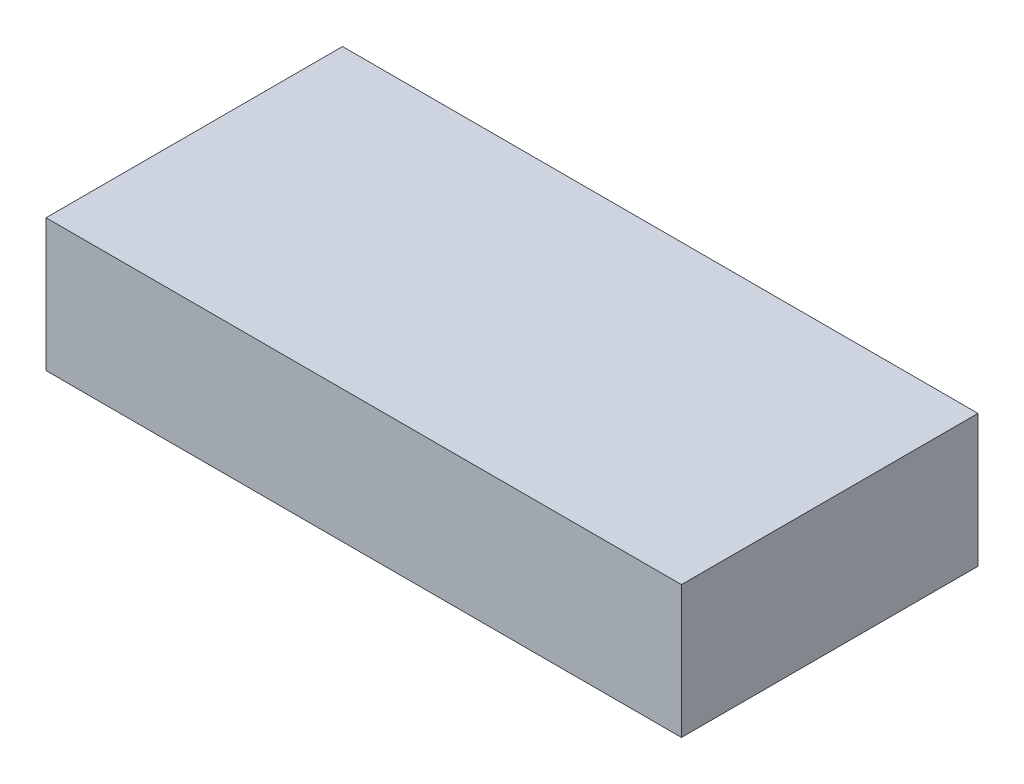
ISO-10303-21;
HEADER;
FILE_DESCRIPTION(('STEP AP214'),'2;1');
FILE_NAME('part.step','',(''),(''),'','','');
FILE_SCHEMA(('AUTOMOTIVE_DESIGN { 1 0 10303 214 1 1 1 1 }'));
ENDSEC;
DATA;
#1=APPLICATION_CONTEXT('core data for automotive mechanical design processes');
#2=APPLICATION_PROTOCOL_DEFINITION('international standard','automotive_design',2000,#1);
#3=PRODUCT_CONTEXT('',#1,'mechanical');
#4=PRODUCT('Part','Part','',(#3));
#5=PRODUCT_RELATED_PRODUCT_CATEGORY('part','',(#4));
#6=PRODUCT_DEFINITION_FORMATION('','',#4);
#7=PRODUCT_DEFINITION_CONTEXT('part definition',#1,'design');
#8=PRODUCT_DEFINITION('design','',#6,#7);
#9=PRODUCT_DEFINITION_SHAPE('','',#8);
#10=(LENGTH_UNIT() NAMED_UNIT(*) SI_UNIT(.MILLI.,.METRE.));
#11=(NAMED_UNIT(*) PLANE_ANGLE_UNIT() SI_UNIT($,.RADIAN.));
#12=(NAMED_UNIT(*) SI_UNIT($,.STERADIAN.) SOLID_ANGLE_UNIT());
#13=UNCERTAINTY_MEASURE_WITH_UNIT(LENGTH_MEASURE(1.E-05),#10,'distance_accuracy_value','');
#14=(GEOMETRIC_REPRESENTATION_CONTEXT(3) GLOBAL_UNCERTAINTY_ASSIGNED_CONTEXT((#13)) GLOBAL_UNIT_ASSIGNED_CONTEXT((#10,
#11,#12)) REPRESENTATION_CONTEXT('',''));
#15=CARTESIAN_POINT('',(0.,0.,0.));
#16=DIRECTION('',(0.,0.,1.));
#17=DIRECTION('',(1.,0.,0.));
#18=AXIS2_PLACEMENT_3D('',#15,#16,#17);
#19=CARTESIAN_POINT('',(0.,25.,0.));
#20=DIRECTION('',(1.,0.,0.));
#21=DIRECTION('',(0.,0.,-1.));
#22=AXIS2_PLACEMENT_3D('',#19,#20,#21);
#23=PLANE('',#22);
#24=DIRECTION('',(0.,0.,1.));
#25=VECTOR('',#24,1.);
#26=CARTESIAN_POINT('',(0.,0.,0.));
#27=LINE('',#26,#25);
#28=CARTESIAN_POINT('',(0.,0.,-56.));
#29=VERTEX_POINT('',#28);
#30=CARTESIAN_POINT('',(0.,0.,0.));
#31=VERTEX_POINT('',#30);
#32=EDGE_CURVE('E98',#29,#31,#27,.T.);
#33=ORIENTED_EDGE('',*,*,#32,.T.);
#34=DIRECTION('',(0.,-1.,0.));
#35=VECTOR('',#34,1.);
#36=CARTESIAN_POINT('',(0.,25.,0.));
#37=LINE('',#36,#35);
#38=CARTESIAN_POINT('',(0.,25.,0.));
#39=VERTEX_POINT('',#38);
#40=EDGE_CURVE('E11',#39,#31,#37,.T.);
#41=ORIENTED_EDGE('',*,*,#40,.F.);
#42=DIRECTION('',(0.,0.,1.));
#43=VECTOR('',#42,1.);
#44=CARTESIAN_POINT('',(0.,25.,0.));
#45=LINE('',#44,#43);
#46=CARTESIAN_POINT('',(0.,25.,-56.));
#47=VERTEX_POINT('',#46);
#48=EDGE_CURVE('E86',#47,#39,#45,.T.);
#49=ORIENTED_EDGE('',*,*,#48,.F.);
#50=DIRECTION('',(0.,-1.,0.));
#51=VECTOR('',#50,1.);
#52=CARTESIAN_POINT('',(0.,25.,-56.));
#53=LINE('',#52,#51);
#54=EDGE_CURVE('E94',#47,#29,#53,.T.);
#55=ORIENTED_EDGE('',*,*,#54,.T.);
#56=EDGE_LOOP('',(#33,#41,#49,#55));
#57=FACE_BOUND('',#56,.T.);
#58=ADVANCED_FACE('F35',(#57),#23,.F.);
#59=CARTESIAN_POINT('',(0.,25.,0.));
#60=DIRECTION('',(0.,0.,-1.));
#61=DIRECTION('',(-1.,0.,0.));
#62=AXIS2_PLACEMENT_3D('',#59,#60,#61);
#63=PLANE('',#62);
#64=DIRECTION('',(1.,0.,0.));
#65=VECTOR('',#64,1.);
#66=CARTESIAN_POINT('',(0.,0.,0.));
#67=LINE('',#66,#65);
#68=CARTESIAN_POINT('',(120.,0.,0.));
#69=VERTEX_POINT('',#68);
#70=EDGE_CURVE('E90',#31,#69,#67,.T.);
#71=ORIENTED_EDGE('',*,*,#70,.T.);
#72=DIRECTION('',(0.,-1.,0.));
#73=VECTOR('',#72,1.);
#74=CARTESIAN_POINT('',(120.,25.,0.));
#75=LINE('',#74,#73);
#76=CARTESIAN_POINT('',(120.,25.,0.));
#77=VERTEX_POINT('',#76);
#78=EDGE_CURVE('E43',#77,#69,#75,.T.);
#79=ORIENTED_EDGE('',*,*,#78,.F.);
#80=DIRECTION('',(1.,0.,0.));
#81=VECTOR('',#80,1.);
#82=CARTESIAN_POINT('',(0.,25.,0.));
#83=LINE('',#82,#81);
#84=EDGE_CURVE('E81',#39,#77,#83,.T.);
#85=ORIENTED_EDGE('',*,*,#84,.F.);
#86=ORIENTED_EDGE('',*,*,#40,.T.);
#87=EDGE_LOOP('',(#71,#79,#85,#86));
#88=FACE_BOUND('',#87,.T.);
#89=ADVANCED_FACE('F89',(#88),#63,.F.);
#90=CARTESIAN_POINT('',(120.,25.,0.));
#91=DIRECTION('',(-1.,0.,0.));
#92=DIRECTION('',(0.,0.,1.));
#93=AXIS2_PLACEMENT_3D('',#90,#91,#92);
#94=PLANE('',#93);
#95=DIRECTION('',(0.,0.,-1.));
#96=VECTOR('',#95,1.);
#97=CARTESIAN_POINT('',(120.,0.,0.));
#98=LINE('',#97,#96);
#99=CARTESIAN_POINT('',(120.,0.,-56.));
#100=VERTEX_POINT('',#99);
#101=EDGE_CURVE('E68',#69,#100,#98,.T.);
#102=ORIENTED_EDGE('',*,*,#101,.T.);
#103=DIRECTION('',(0.,-1.,0.));
#104=VECTOR('',#103,1.);
#105=CARTESIAN_POINT('',(120.,25.,-56.));
#106=LINE('',#105,#104);
#107=CARTESIAN_POINT('',(120.,25.,-56.));
#108=VERTEX_POINT('',#107);
#109=EDGE_CURVE('E91',#108,#100,#106,.T.);
#110=ORIENTED_EDGE('',*,*,#109,.F.);
#111=DIRECTION('',(0.,0.,-1.));
#112=VECTOR('',#111,1.);
#113=CARTESIAN_POINT('',(120.,25.,0.));
#114=LINE('',#113,#112);
#115=EDGE_CURVE('E84',#77,#108,#114,.T.);
#116=ORIENTED_EDGE('',*,*,#115,.F.);
#117=ORIENTED_EDGE('',*,*,#78,.T.);
#118=EDGE_LOOP('',(#102,#110,#116,#117));
#119=FACE_BOUND('',#118,.T.);
#120=ADVANCED_FACE('F92',(#119),#94,.F.);
#121=CARTESIAN_POINT('',(0.,25.,-56.));
#122=DIRECTION('',(0.,0.,1.));
#123=DIRECTION('',(1.,0.,0.));
#124=AXIS2_PLACEMENT_3D('',#121,#122,#123);
#125=PLANE('',#124);
#126=DIRECTION('',(-1.,0.,0.));
#127=VECTOR('',#126,1.);
#128=CARTESIAN_POINT('',(0.,0.,-56.));
#129=LINE('',#128,#127);
#130=EDGE_CURVE('E74',#100,#29,#129,.T.);
#131=ORIENTED_EDGE('',*,*,#130,.T.);
#132=ORIENTED_EDGE('',*,*,#54,.F.);
#133=DIRECTION('',(-1.,0.,0.));
#134=VECTOR('',#133,1.);
#135=CARTESIAN_POINT('',(0.,25.,-56.));
#136=LINE('',#135,#134);
#137=EDGE_CURVE('E51',#108,#47,#136,.T.);
#138=ORIENTED_EDGE('',*,*,#137,.F.);
#139=ORIENTED_EDGE('',*,*,#109,.T.);
#140=EDGE_LOOP('',(#131,#132,#138,#139));
#141=FACE_BOUND('',#140,.T.);
#142=ADVANCED_FACE('F105',(#141),#125,.F.);
#143=CARTESIAN_POINT('',(0.,25.,0.));
#144=DIRECTION('',(0.,-1.,0.));
#145=DIRECTION('',(0.,0.,-1.));
#146=AXIS2_PLACEMENT_3D('',#143,#144,#145);
#147=PLANE('',#146);
#148=ORIENTED_EDGE('',*,*,#48,.T.);
#149=ORIENTED_EDGE('',*,*,#84,.T.);
#150=ORIENTED_EDGE('',*,*,#115,.T.);
#151=ORIENTED_EDGE('',*,*,#137,.T.);
#152=EDGE_LOOP('',(#148,#149,#150,#151));
#153=FACE_BOUND('',#152,.T.);
#154=ADVANCED_FACE('F82',(#153),#147,.F.);
#155=CARTESIAN_POINT('',(0.,0.,0.));
#156=DIRECTION('',(0.,-1.,0.));
#157=DIRECTION('',(0.,0.,-1.));
#158=AXIS2_PLACEMENT_3D('',#155,#156,#157);
#159=PLANE('',#158);
#160=ORIENTED_EDGE('',*,*,#32,.F.);
#161=ORIENTED_EDGE('',*,*,#130,.F.);
#162=ORIENTED_EDGE('',*,*,#101,.F.);
#163=ORIENTED_EDGE('',*,*,#70,.F.);
#164=EDGE_LOOP('',(#160,#161,#162,#163));
#165=FACE_BOUND('',#164,.T.);
#166=ADVANCED_FACE('F108',(#165),#159,.T.);
#167=CLOSED_SHELL('',(#58,#89,#120,#142,#154,#166));
#168=MANIFOLD_SOLID_BREP('B2',#167);
#169=ADVANCED_BREP_SHAPE_REPRESENTATION('',(#18,#168),#14);
#170=SHAPE_DEFINITION_REPRESENTATION(#9,#169);
ENDSEC;
END-ISO-10303-21;
